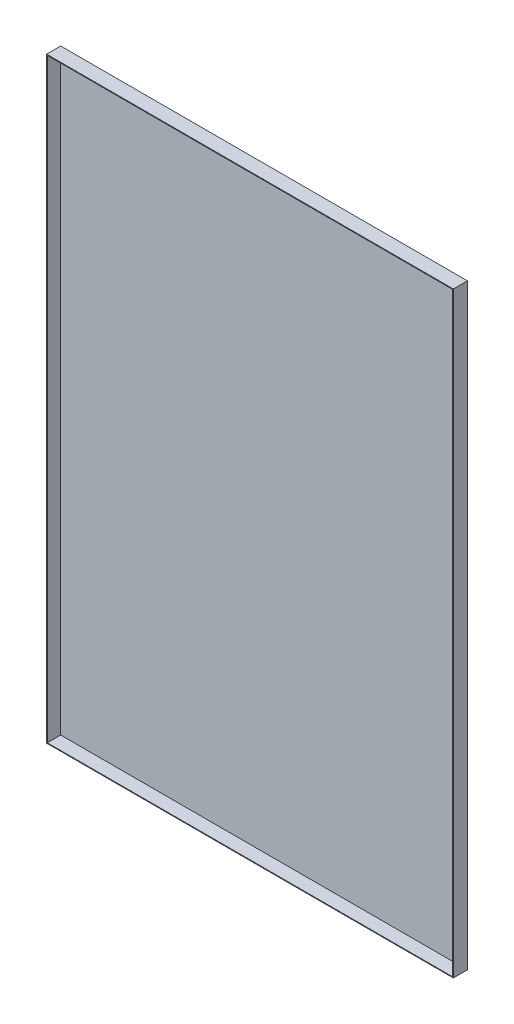
ISO-10303-21;
HEADER;
FILE_DESCRIPTION(('STEP AP214'),'2;1');
FILE_NAME('part.step','',(''),(''),'','','');
FILE_SCHEMA(('AUTOMOTIVE_DESIGN { 1 0 10303 214 1 1 1 1 }'));
ENDSEC;
DATA;
#1=APPLICATION_CONTEXT('core data for automotive mechanical design processes');
#2=APPLICATION_PROTOCOL_DEFINITION('international standard','automotive_design',2000,#1);
#3=PRODUCT_CONTEXT('',#1,'mechanical');
#4=PRODUCT('Part','Part','',(#3));
#5=PRODUCT_RELATED_PRODUCT_CATEGORY('part','',(#4));
#6=PRODUCT_DEFINITION_FORMATION('','',#4);
#7=PRODUCT_DEFINITION_CONTEXT('part definition',#1,'design');
#8=PRODUCT_DEFINITION('design','',#6,#7);
#9=PRODUCT_DEFINITION_SHAPE('','',#8);
#10=(LENGTH_UNIT() NAMED_UNIT(*) SI_UNIT(.MILLI.,.METRE.));
#11=(NAMED_UNIT(*) PLANE_ANGLE_UNIT() SI_UNIT($,.RADIAN.));
#12=(NAMED_UNIT(*) SI_UNIT($,.STERADIAN.) SOLID_ANGLE_UNIT());
#13=UNCERTAINTY_MEASURE_WITH_UNIT(LENGTH_MEASURE(1.E-05),#10,'distance_accuracy_value','');
#14=(GEOMETRIC_REPRESENTATION_CONTEXT(3) GLOBAL_UNCERTAINTY_ASSIGNED_CONTEXT((#13)) GLOBAL_UNIT_ASSIGNED_CONTEXT((#10,
#11,#12)) REPRESENTATION_CONTEXT('',''));
#15=CARTESIAN_POINT('',(0.,0.,0.));
#16=DIRECTION('',(0.,0.,1.));
#17=DIRECTION('',(1.,0.,0.));
#18=AXIS2_PLACEMENT_3D('',#15,#16,#17);
#19=CARTESIAN_POINT('',(289.,424.,20.));
#20=DIRECTION('',(-1.,0.,0.));
#21=DIRECTION('',(0.,-1.,0.));
#22=AXIS2_PLACEMENT_3D('',#19,#20,#21);
#23=PLANE('',#22);
#24=DIRECTION('',(0.,1.,0.));
#25=VECTOR('',#24,1.);
#26=CARTESIAN_POINT('',(289.,424.,0.));
#27=LINE('',#26,#25);
#28=CARTESIAN_POINT('',(289.,-424.,0.));
#29=VERTEX_POINT('',#28);
#30=CARTESIAN_POINT('',(289.,424.,0.));
#31=VERTEX_POINT('',#30);
#32=EDGE_CURVE('E167',#29,#31,#27,.T.);
#33=ORIENTED_EDGE('',*,*,#32,.T.);
#34=DIRECTION('',(0.,0.,-1.));
#35=VECTOR('',#34,1.);
#36=CARTESIAN_POINT('',(289.,424.,20.));
#37=LINE('',#36,#35);
#38=CARTESIAN_POINT('',(289.,424.,20.));
#39=VERTEX_POINT('',#38);
#40=EDGE_CURVE('E11',#39,#31,#37,.T.);
#41=ORIENTED_EDGE('',*,*,#40,.F.);
#42=DIRECTION('',(0.,1.,0.));
#43=VECTOR('',#42,1.);
#44=CARTESIAN_POINT('',(289.,424.,20.));
#45=LINE('',#44,#43);
#46=CARTESIAN_POINT('',(289.,-424.,20.));
#47=VERTEX_POINT('',#46);
#48=EDGE_CURVE('E156',#47,#39,#45,.T.);
#49=ORIENTED_EDGE('',*,*,#48,.F.);
#50=DIRECTION('',(0.,0.,-1.));
#51=VECTOR('',#50,1.);
#52=CARTESIAN_POINT('',(289.,-424.,20.));
#53=LINE('',#52,#51);
#54=EDGE_CURVE('E166',#47,#29,#53,.T.);
#55=ORIENTED_EDGE('',*,*,#54,.T.);
#56=EDGE_LOOP('',(#33,#41,#49,#55));
#57=FACE_BOUND('',#56,.T.);
#58=ADVANCED_FACE('F39',(#57),#23,.F.);
#59=CARTESIAN_POINT('',(-289.,424.,20.));
#60=DIRECTION('',(0.,-1.,0.));
#61=DIRECTION('',(0.,0.,-1.));
#62=AXIS2_PLACEMENT_3D('',#59,#60,#61);
#63=PLANE('',#62);
#64=DIRECTION('',(-1.,0.,0.));
#65=VECTOR('',#64,1.);
#66=CARTESIAN_POINT('',(-289.,424.,0.));
#67=LINE('',#66,#65);
#68=CARTESIAN_POINT('',(-289.,424.,0.));
#69=VERTEX_POINT('',#68);
#70=EDGE_CURVE('E171',#31,#69,#67,.T.);
#71=ORIENTED_EDGE('',*,*,#70,.T.);
#72=DIRECTION('',(0.,0.,-1.));
#73=VECTOR('',#72,1.);
#74=CARTESIAN_POINT('',(-289.,424.,20.));
#75=LINE('',#74,#73);
#76=CARTESIAN_POINT('',(-289.,424.,20.));
#77=VERTEX_POINT('',#76);
#78=EDGE_CURVE('E47',#77,#69,#75,.T.);
#79=ORIENTED_EDGE('',*,*,#78,.F.);
#80=DIRECTION('',(-1.,0.,0.));
#81=VECTOR('',#80,1.);
#82=CARTESIAN_POINT('',(-289.,424.,20.));
#83=LINE('',#82,#81);
#84=EDGE_CURVE('E91',#39,#77,#83,.T.);
#85=ORIENTED_EDGE('',*,*,#84,.F.);
#86=ORIENTED_EDGE('',*,*,#40,.T.);
#87=EDGE_LOOP('',(#71,#79,#85,#86));
#88=FACE_BOUND('',#87,.T.);
#89=ADVANCED_FACE('F206',(#88),#63,.F.);
#90=CARTESIAN_POINT('',(-289.,424.,20.));
#91=DIRECTION('',(1.,0.,0.));
#92=DIRECTION('',(0.,1.,0.));
#93=AXIS2_PLACEMENT_3D('',#90,#91,#92);
#94=PLANE('',#93);
#95=DIRECTION('',(0.,-1.,0.));
#96=VECTOR('',#95,1.);
#97=CARTESIAN_POINT('',(-289.,424.,0.));
#98=LINE('',#97,#96);
#99=CARTESIAN_POINT('',(-289.,-424.,0.));
#100=VERTEX_POINT('',#99);
#101=EDGE_CURVE('E174',#69,#100,#98,.T.);
#102=ORIENTED_EDGE('',*,*,#101,.T.);
#103=DIRECTION('',(0.,0.,-1.));
#104=VECTOR('',#103,1.);
#105=CARTESIAN_POINT('',(-289.,-424.,20.));
#106=LINE('',#105,#104);
#107=CARTESIAN_POINT('',(-289.,-424.,20.));
#108=VERTEX_POINT('',#107);
#109=EDGE_CURVE('E181',#108,#100,#106,.T.);
#110=ORIENTED_EDGE('',*,*,#109,.F.);
#111=DIRECTION('',(0.,-1.,0.));
#112=VECTOR('',#111,1.);
#113=CARTESIAN_POINT('',(-289.,424.,20.));
#114=LINE('',#113,#112);
#115=EDGE_CURVE('E161',#77,#108,#114,.T.);
#116=ORIENTED_EDGE('',*,*,#115,.F.);
#117=ORIENTED_EDGE('',*,*,#78,.T.);
#118=EDGE_LOOP('',(#102,#110,#116,#117));
#119=FACE_BOUND('',#118,.T.);
#120=ADVANCED_FACE('F188',(#119),#94,.F.);
#121=CARTESIAN_POINT('',(-289.,-424.,20.));
#122=DIRECTION('',(0.,1.,0.));
#123=DIRECTION('',(0.,0.,1.));
#124=AXIS2_PLACEMENT_3D('',#121,#122,#123);
#125=PLANE('',#124);
#126=DIRECTION('',(1.,0.,0.));
#127=VECTOR('',#126,1.);
#128=CARTESIAN_POINT('',(-289.,-424.,0.));
#129=LINE('',#128,#127);
#130=EDGE_CURVE('E84',#100,#29,#129,.T.);
#131=ORIENTED_EDGE('',*,*,#130,.T.);
#132=ORIENTED_EDGE('',*,*,#54,.F.);
#133=DIRECTION('',(1.,0.,0.));
#134=VECTOR('',#133,1.);
#135=CARTESIAN_POINT('',(-289.,-424.,20.));
#136=LINE('',#135,#134);
#137=EDGE_CURVE('E63',#108,#47,#136,.T.);
#138=ORIENTED_EDGE('',*,*,#137,.F.);
#139=ORIENTED_EDGE('',*,*,#109,.T.);
#140=EDGE_LOOP('',(#131,#132,#138,#139));
#141=FACE_BOUND('',#140,.T.);
#142=ADVANCED_FACE('F196',(#141),#125,.F.);
#143=CARTESIAN_POINT('',(0.,0.,20.));
#144=DIRECTION('',(0.,0.,1.));
#145=DIRECTION('',(1.,0.,0.));
#146=AXIS2_PLACEMENT_3D('',#143,#144,#145);
#147=PLANE('',#146);
#148=DIRECTION('',(0.,1.,0.));
#149=VECTOR('',#148,1.);
#150=CARTESIAN_POINT('',(288.,424.,20.));
#151=LINE('',#150,#149);
#152=CARTESIAN_POINT('',(288.,-423.,20.));
#153=VERTEX_POINT('',#152);
#154=CARTESIAN_POINT('',(288.,423.,20.));
#155=VERTEX_POINT('',#154);
#156=EDGE_CURVE('E140',#153,#155,#151,.T.);
#157=ORIENTED_EDGE('',*,*,#156,.F.);
#158=DIRECTION('',(1.,0.,0.));
#159=VECTOR('',#158,1.);
#160=CARTESIAN_POINT('',(-289.,-423.,20.));
#161=LINE('',#160,#159);
#162=CARTESIAN_POINT('',(-288.,-423.,20.));
#163=VERTEX_POINT('',#162);
#164=EDGE_CURVE('E153',#163,#153,#161,.T.);
#165=ORIENTED_EDGE('',*,*,#164,.F.);
#166=DIRECTION('',(0.,-1.,0.));
#167=VECTOR('',#166,1.);
#168=CARTESIAN_POINT('',(-288.,424.,20.));
#169=LINE('',#168,#167);
#170=CARTESIAN_POINT('',(-288.,423.,20.));
#171=VERTEX_POINT('',#170);
#172=EDGE_CURVE('E150',#171,#163,#169,.T.);
#173=ORIENTED_EDGE('',*,*,#172,.F.);
#174=DIRECTION('',(-1.,0.,0.));
#175=VECTOR('',#174,1.);
#176=CARTESIAN_POINT('',(-289.,423.,20.));
#177=LINE('',#176,#175);
#178=EDGE_CURVE('E129',#155,#171,#177,.T.);
#179=ORIENTED_EDGE('',*,*,#178,.F.);
#180=EDGE_LOOP('',(#157,#165,#173,#179));
#181=FACE_BOUND('',#180,.T.);
#182=ORIENTED_EDGE('',*,*,#48,.T.);
#183=ORIENTED_EDGE('',*,*,#84,.T.);
#184=ORIENTED_EDGE('',*,*,#115,.T.);
#185=ORIENTED_EDGE('',*,*,#137,.T.);
#186=EDGE_LOOP('',(#182,#183,#184,#185));
#187=FACE_BOUND('',#186,.T.);
#188=ADVANCED_FACE('F198',(#181,#187),#147,.T.);
#189=CARTESIAN_POINT('',(0.,0.,0.));
#190=DIRECTION('',(0.,0.,1.));
#191=DIRECTION('',(1.,0.,0.));
#192=AXIS2_PLACEMENT_3D('',#189,#190,#191);
#193=PLANE('',#192);
#194=ORIENTED_EDGE('',*,*,#32,.F.);
#195=ORIENTED_EDGE('',*,*,#130,.F.);
#196=ORIENTED_EDGE('',*,*,#101,.F.);
#197=ORIENTED_EDGE('',*,*,#70,.F.);
#198=EDGE_LOOP('',(#194,#195,#196,#197));
#199=FACE_BOUND('',#198,.T.);
#200=ADVANCED_FACE('F192',(#199),#193,.F.);
#201=CARTESIAN_POINT('',(288.,424.,20.));
#202=DIRECTION('',(-1.,0.,0.));
#203=DIRECTION('',(0.,-1.,0.));
#204=AXIS2_PLACEMENT_3D('',#201,#202,#203);
#205=PLANE('',#204);
#206=DIRECTION('',(0.,1.,0.));
#207=VECTOR('',#206,1.);
#208=CARTESIAN_POINT('',(288.,424.,1.));
#209=LINE('',#208,#207);
#210=CARTESIAN_POINT('',(288.,-423.,1.));
#211=VERTEX_POINT('',#210);
#212=CARTESIAN_POINT('',(288.,423.,1.));
#213=VERTEX_POINT('',#212);
#214=EDGE_CURVE('E119',#211,#213,#209,.T.);
#215=ORIENTED_EDGE('',*,*,#214,.F.);
#216=DIRECTION('',(0.,0.,-1.));
#217=VECTOR('',#216,1.);
#218=CARTESIAN_POINT('',(288.,-423.,20.));
#219=LINE('',#218,#217);
#220=EDGE_CURVE('E144',#153,#211,#219,.T.);
#221=ORIENTED_EDGE('',*,*,#220,.F.);
#222=ORIENTED_EDGE('',*,*,#156,.T.);
#223=DIRECTION('',(0.,0.,-1.));
#224=VECTOR('',#223,1.);
#225=CARTESIAN_POINT('',(288.,423.,20.));
#226=LINE('',#225,#224);
#227=EDGE_CURVE('E133',#155,#213,#226,.T.);
#228=ORIENTED_EDGE('',*,*,#227,.T.);
#229=EDGE_LOOP('',(#215,#221,#222,#228));
#230=FACE_BOUND('',#229,.T.);
#231=ADVANCED_FACE('F233',(#230),#205,.T.);
#232=CARTESIAN_POINT('',(-289.,423.,20.));
#233=DIRECTION('',(0.,-1.,0.));
#234=DIRECTION('',(0.,0.,-1.));
#235=AXIS2_PLACEMENT_3D('',#232,#233,#234);
#236=PLANE('',#235);
#237=DIRECTION('',(-1.,0.,0.));
#238=VECTOR('',#237,1.);
#239=CARTESIAN_POINT('',(-289.,423.,1.));
#240=LINE('',#239,#238);
#241=CARTESIAN_POINT('',(-288.,423.,1.));
#242=VERTEX_POINT('',#241);
#243=EDGE_CURVE('E113',#213,#242,#240,.T.);
#244=ORIENTED_EDGE('',*,*,#243,.F.);
#245=ORIENTED_EDGE('',*,*,#227,.F.);
#246=ORIENTED_EDGE('',*,*,#178,.T.);
#247=DIRECTION('',(0.,0.,-1.));
#248=VECTOR('',#247,1.);
#249=CARTESIAN_POINT('',(-288.,423.,20.));
#250=LINE('',#249,#248);
#251=EDGE_CURVE('E126',#171,#242,#250,.T.);
#252=ORIENTED_EDGE('',*,*,#251,.T.);
#253=EDGE_LOOP('',(#244,#245,#246,#252));
#254=FACE_BOUND('',#253,.T.);
#255=ADVANCED_FACE('F127',(#254),#236,.T.);
#256=CARTESIAN_POINT('',(-288.,424.,20.));
#257=DIRECTION('',(1.,0.,0.));
#258=DIRECTION('',(0.,1.,0.));
#259=AXIS2_PLACEMENT_3D('',#256,#257,#258);
#260=PLANE('',#259);
#261=DIRECTION('',(0.,-1.,0.));
#262=VECTOR('',#261,1.);
#263=CARTESIAN_POINT('',(-288.,424.,1.));
#264=LINE('',#263,#262);
#265=CARTESIAN_POINT('',(-288.,-423.,1.));
#266=VERTEX_POINT('',#265);
#267=EDGE_CURVE('E117',#242,#266,#264,.T.);
#268=ORIENTED_EDGE('',*,*,#267,.F.);
#269=ORIENTED_EDGE('',*,*,#251,.F.);
#270=ORIENTED_EDGE('',*,*,#172,.T.);
#271=DIRECTION('',(0.,0.,-1.));
#272=VECTOR('',#271,1.);
#273=CARTESIAN_POINT('',(-288.,-423.,20.));
#274=LINE('',#273,#272);
#275=EDGE_CURVE('E54',#163,#266,#274,.T.);
#276=ORIENTED_EDGE('',*,*,#275,.T.);
#277=EDGE_LOOP('',(#268,#269,#270,#276));
#278=FACE_BOUND('',#277,.T.);
#279=ADVANCED_FACE('F135',(#278),#260,.T.);
#280=CARTESIAN_POINT('',(-289.,-423.,20.));
#281=DIRECTION('',(0.,1.,0.));
#282=DIRECTION('',(0.,0.,1.));
#283=AXIS2_PLACEMENT_3D('',#280,#281,#282);
#284=PLANE('',#283);
#285=DIRECTION('',(1.,0.,0.));
#286=VECTOR('',#285,1.);
#287=CARTESIAN_POINT('',(-289.,-423.,1.));
#288=LINE('',#287,#286);
#289=EDGE_CURVE('E137',#266,#211,#288,.T.);
#290=ORIENTED_EDGE('',*,*,#289,.F.);
#291=ORIENTED_EDGE('',*,*,#275,.F.);
#292=ORIENTED_EDGE('',*,*,#164,.T.);
#293=ORIENTED_EDGE('',*,*,#220,.T.);
#294=EDGE_LOOP('',(#290,#291,#292,#293));
#295=FACE_BOUND('',#294,.T.);
#296=ADVANCED_FACE('F263',(#295),#284,.T.);
#297=CARTESIAN_POINT('',(0.,0.,1.));
#298=DIRECTION('',(0.,0.,1.));
#299=DIRECTION('',(1.,0.,0.));
#300=AXIS2_PLACEMENT_3D('',#297,#298,#299);
#301=PLANE('',#300);
#302=ORIENTED_EDGE('',*,*,#214,.T.);
#303=ORIENTED_EDGE('',*,*,#243,.T.);
#304=ORIENTED_EDGE('',*,*,#267,.T.);
#305=ORIENTED_EDGE('',*,*,#289,.T.);
#306=EDGE_LOOP('',(#302,#303,#304,#305));
#307=FACE_BOUND('',#306,.T.);
#308=ADVANCED_FACE('F115',(#307),#301,.T.);
#309=CLOSED_SHELL('',(#58,#89,#120,#142,#188,#200,#231,#255,#279,#296,#308));
#310=MANIFOLD_SOLID_BREP('B2',#309);
#311=ADVANCED_BREP_SHAPE_REPRESENTATION('',(#18,#310),#14);
#312=SHAPE_DEFINITION_REPRESENTATION(#9,#311);
ENDSEC;
END-ISO-10303-21;
